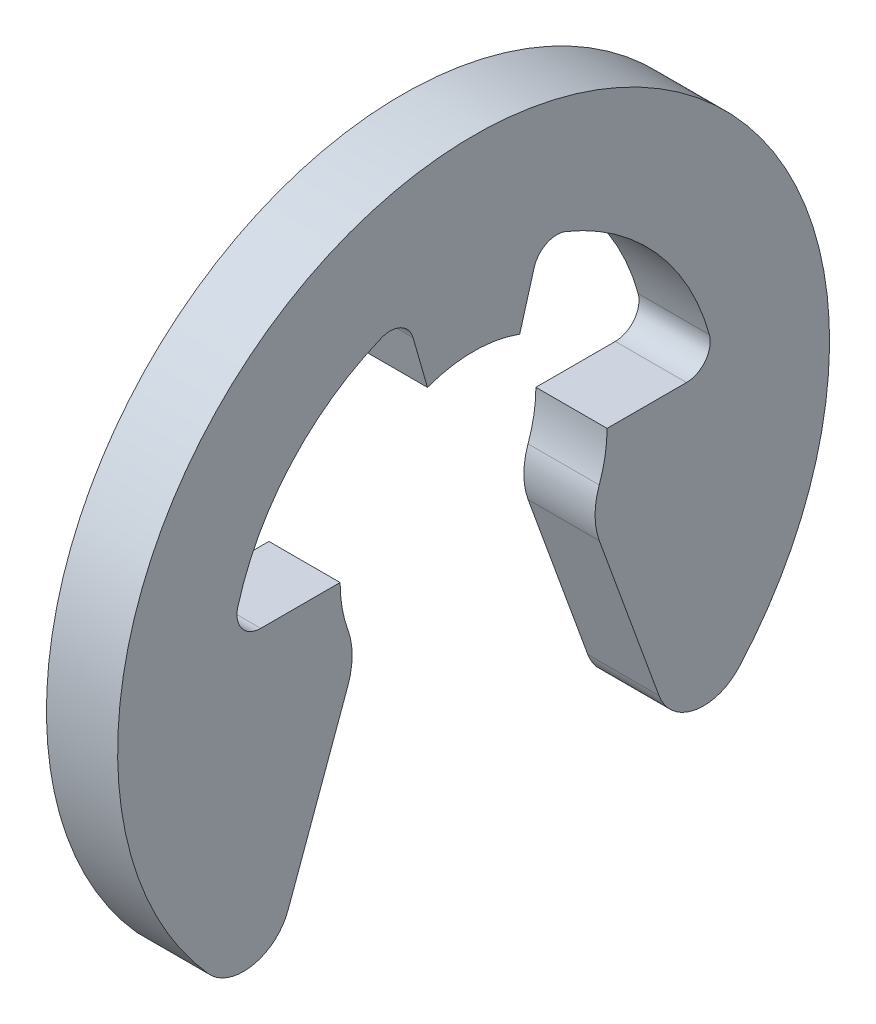
ISO-10303-21;
HEADER;
FILE_DESCRIPTION(('STEP AP214'),'2;1');
FILE_NAME('part.step','',(''),(''),'','','');
FILE_SCHEMA(('AUTOMOTIVE_DESIGN { 1 0 10303 214 1 1 1 1 }'));
ENDSEC;
DATA;
#1=APPLICATION_CONTEXT('core data for automotive mechanical design processes');
#2=APPLICATION_PROTOCOL_DEFINITION('international standard','automotive_design',2000,#1);
#3=PRODUCT_CONTEXT('',#1,'mechanical');
#4=PRODUCT('Part','Part','',(#3));
#5=PRODUCT_RELATED_PRODUCT_CATEGORY('part','',(#4));
#6=PRODUCT_DEFINITION_FORMATION('','',#4);
#7=PRODUCT_DEFINITION_CONTEXT('part definition',#1,'design');
#8=PRODUCT_DEFINITION('design','',#6,#7);
#9=PRODUCT_DEFINITION_SHAPE('','',#8);
#10=(LENGTH_UNIT() NAMED_UNIT(*) SI_UNIT(.MILLI.,.METRE.));
#11=(NAMED_UNIT(*) PLANE_ANGLE_UNIT() SI_UNIT($,.RADIAN.));
#12=(NAMED_UNIT(*) SI_UNIT($,.STERADIAN.) SOLID_ANGLE_UNIT());
#13=UNCERTAINTY_MEASURE_WITH_UNIT(LENGTH_MEASURE(1.E-05),#10,'distance_accuracy_value','');
#14=(GEOMETRIC_REPRESENTATION_CONTEXT(3) GLOBAL_UNCERTAINTY_ASSIGNED_CONTEXT((#13)) GLOBAL_UNIT_ASSIGNED_CONTEXT((#10,
#11,#12)) REPRESENTATION_CONTEXT('',''));
#15=CARTESIAN_POINT('',(0.,0.,0.));
#16=DIRECTION('',(0.,0.,1.));
#17=DIRECTION('',(1.,0.,0.));
#18=AXIS2_PLACEMENT_3D('',#15,#16,#17);
#19=CARTESIAN_POINT('',(0.399999999999998,0.333333333333338,-1.19608737139061));
#20=DIRECTION('',(-1.,0.,0.));
#21=DIRECTION('',(0.,0.,1.));
#22=AXIS2_PLACEMENT_3D('',#19,#20,#21);
#23=CYLINDRICAL_SURFACE('',#22,0.133333333333334);
#24=CARTESIAN_POINT('',(0.,0.333333333333338,-1.19608737139061));
#25=DIRECTION('',(-1.,0.,0.));
#26=DIRECTION('',(0.,0.,1.));
#27=AXIS2_PLACEMENT_3D('',#24,#25,#26);
#28=CIRCLE('',#27,0.133333333333334);
#29=CARTESIAN_POINT('',(0.,0.369127516778589,-1.32452628375462));
#30=VERTEX_POINT('',#29);
#31=CARTESIAN_POINT('',(0.,0.200000000000033,-1.19608737139058));
#32=VERTEX_POINT('',#31);
#33=EDGE_CURVE('E199',#30,#32,#28,.T.);
#34=ORIENTED_EDGE('',*,*,#33,.T.);
#35=DIRECTION('',(-1.,0.,0.));
#36=VECTOR('',#35,1.);
#37=CARTESIAN_POINT('',(0.399999999999998,0.200000000000033,-1.19608737139058));
#38=LINE('',#37,#36);
#39=CARTESIAN_POINT('',(0.399999999999998,0.200000000000033,-1.19608737139058));
#40=VERTEX_POINT('',#39);
#41=EDGE_CURVE('E11',#40,#32,#38,.T.);
#42=ORIENTED_EDGE('',*,*,#41,.F.);
#43=CARTESIAN_POINT('',(0.399999999999998,0.333333333333338,-1.19608737139061));
#44=DIRECTION('',(-1.,0.,0.));
#45=DIRECTION('',(0.,0.,1.));
#46=AXIS2_PLACEMENT_3D('',#43,#44,#45);
#47=CIRCLE('',#46,0.133333333333334);
#48=CARTESIAN_POINT('',(0.399999999999998,0.369127516778589,-1.32452628375462));
#49=VERTEX_POINT('',#48);
#50=EDGE_CURVE('E121',#49,#40,#47,.T.);
#51=ORIENTED_EDGE('',*,*,#50,.F.);
#52=DIRECTION('',(-1.,0.,0.));
#53=VECTOR('',#52,1.);
#54=CARTESIAN_POINT('',(0.399999999999998,0.369127516778589,-1.32452628375462));
#55=LINE('',#54,#53);
#56=EDGE_CURVE('E48',#49,#30,#55,.T.);
#57=ORIENTED_EDGE('',*,*,#56,.T.);
#58=EDGE_LOOP('',(#34,#42,#51,#57));
#59=FACE_BOUND('',#58,.T.);
#60=ADVANCED_FACE('F32',(#59),#23,.F.);
#61=CARTESIAN_POINT('',(0.399999999999998,0.200000000000033,-0.750000000000015));
#62=DIRECTION('',(0.,1.,0.));
#63=DIRECTION('',(0.,0.,1.));
#64=AXIS2_PLACEMENT_3D('',#61,#62,#63);
#65=PLANE('',#64);
#66=DIRECTION('',(0.,0.,-1.));
#67=VECTOR('',#66,1.);
#68=CARTESIAN_POINT('',(0.,0.200000000000033,-0.750000000000015));
#69=LINE('',#68,#67);
#70=CARTESIAN_POINT('',(0.,0.200000000000033,-0.750000000000015));
#71=VERTEX_POINT('',#70);
#72=EDGE_CURVE('E201',#71,#32,#69,.T.);
#73=ORIENTED_EDGE('',*,*,#72,.F.);
#74=DIRECTION('',(-1.,0.,0.));
#75=VECTOR('',#74,1.);
#76=CARTESIAN_POINT('',(0.399999999999998,0.200000000000033,-0.750000000000015));
#77=LINE('',#76,#75);
#78=CARTESIAN_POINT('',(0.399999999999998,0.200000000000033,-0.750000000000015));
#79=VERTEX_POINT('',#78);
#80=EDGE_CURVE('E40',#79,#71,#77,.T.);
#81=ORIENTED_EDGE('',*,*,#80,.F.);
#82=DIRECTION('',(0.,0.,-1.));
#83=VECTOR('',#82,1.);
#84=CARTESIAN_POINT('',(0.399999999999998,0.200000000000033,-0.750000000000015));
#85=LINE('',#84,#83);
#86=EDGE_CURVE('E299',#79,#40,#85,.T.);
#87=ORIENTED_EDGE('',*,*,#86,.T.);
#88=ORIENTED_EDGE('',*,*,#41,.T.);
#89=EDGE_LOOP('',(#73,#81,#87,#88));
#90=FACE_BOUND('',#89,.T.);
#91=ADVANCED_FACE('F298',(#90),#65,.T.);
#92=CARTESIAN_POINT('',(0.399999999999998,0.199999999999978,0.));
#93=DIRECTION('',(-1.,0.,0.));
#94=DIRECTION('',(0.,0.,1.));
#95=AXIS2_PLACEMENT_3D('',#92,#93,#94);
#96=CYLINDRICAL_SURFACE('',#95,0.75);
#97=CARTESIAN_POINT('',(0.,0.199999999999978,0.));
#98=DIRECTION('',(-1.,0.,0.));
#99=DIRECTION('',(0.,0.,1.));
#100=AXIS2_PLACEMENT_3D('',#97,#98,#99);
#101=CIRCLE('',#100,0.75);
#102=CARTESIAN_POINT('',(0.,-0.0533632223996827,-0.705908689233412));
#103=VERTEX_POINT('',#102);
#104=EDGE_CURVE('E204',#71,#103,#101,.T.);
#105=ORIENTED_EDGE('',*,*,#104,.T.);
#106=DIRECTION('',(-1.,0.,0.));
#107=VECTOR('',#106,1.);
#108=CARTESIAN_POINT('',(0.399999999999998,-0.0533632223996827,-0.705908689233412));
#109=LINE('',#108,#107);
#110=CARTESIAN_POINT('',(0.399999999999998,-0.0533632223996827,-0.705908689233412));
#111=VERTEX_POINT('',#110);
#112=EDGE_CURVE('E284',#111,#103,#109,.T.);
#113=ORIENTED_EDGE('',*,*,#112,.F.);
#114=CARTESIAN_POINT('',(0.399999999999998,0.199999999999978,0.));
#115=DIRECTION('',(-1.,0.,0.));
#116=DIRECTION('',(0.,0.,1.));
#117=AXIS2_PLACEMENT_3D('',#114,#115,#116);
#118=CIRCLE('',#117,0.75);
#119=EDGE_CURVE('E290',#79,#111,#118,.T.);
#120=ORIENTED_EDGE('',*,*,#119,.F.);
#121=ORIENTED_EDGE('',*,*,#80,.T.);
#122=EDGE_LOOP('',(#105,#113,#120,#121));
#123=FACE_BOUND('',#122,.T.);
#124=ADVANCED_FACE('F288',(#123),#96,.F.);
#125=CARTESIAN_POINT('',(0.399999999999998,-0.188490274346143,-1.08239332349122));
#126=DIRECTION('',(-1.,0.,0.));
#127=DIRECTION('',(0.,0.,1.));
#128=AXIS2_PLACEMENT_3D('',#125,#126,#127);
#129=CYLINDRICAL_SURFACE('',#128,0.399999999999999);
#130=CARTESIAN_POINT('',(0.,-0.188490274346143,-1.08239332349122));
#131=DIRECTION('',(-1.,0.,0.));
#132=DIRECTION('',(0.,0.,1.));
#133=AXIS2_PLACEMENT_3D('',#130,#131,#132);
#134=CIRCLE('',#133,0.399999999999999);
#135=CARTESIAN_POINT('',(0.,-0.32529833167641,-0.706516275176844));
#136=VERTEX_POINT('',#135);
#137=EDGE_CURVE('E207',#136,#103,#134,.T.);
#138=ORIENTED_EDGE('',*,*,#137,.F.);
#139=DIRECTION('',(-1.,0.,0.));
#140=VECTOR('',#139,1.);
#141=CARTESIAN_POINT('',(0.399999999999998,-0.32529833167641,-0.706516275176844));
#142=LINE('',#141,#140);
#143=CARTESIAN_POINT('',(0.399999999999998,-0.32529833167641,-0.706516275176844));
#144=VERTEX_POINT('',#143);
#145=EDGE_CURVE('E282',#144,#136,#142,.T.);
#146=ORIENTED_EDGE('',*,*,#145,.F.);
#147=CARTESIAN_POINT('',(0.399999999999998,-0.188490274346143,-1.08239332349122));
#148=DIRECTION('',(-1.,0.,0.));
#149=DIRECTION('',(0.,0.,1.));
#150=AXIS2_PLACEMENT_3D('',#147,#148,#149);
#151=CIRCLE('',#150,0.399999999999999);
#152=EDGE_CURVE('E547',#144,#111,#151,.T.);
#153=ORIENTED_EDGE('',*,*,#152,.T.);
#154=ORIENTED_EDGE('',*,*,#112,.T.);
#155=EDGE_LOOP('',(#138,#146,#153,#154));
#156=FACE_BOUND('',#155,.T.);
#157=ADVANCED_FACE('F317',(#156),#129,.T.);
#158=CARTESIAN_POINT('',(0.399999999999998,-0.32529833167641,-0.706516275176844));
#159=DIRECTION('',(0.,0.34202014332567,-0.939692620785908));
#160=DIRECTION('',(0.,0.939692620785908,0.34202014332567));
#161=AXIS2_PLACEMENT_3D('',#158,#159,#160);
#162=PLANE('',#161);
#163=DIRECTION('',(0.,-0.939692620785908,-0.34202014332567));
#164=VECTOR('',#163,1.);
#165=CARTESIAN_POINT('',(0.,-0.32529833167641,-0.706516275176844));
#166=LINE('',#165,#164);
#167=CARTESIAN_POINT('',(0.,-1.2463352508001,-1.04174629839815));
#168=VERTEX_POINT('',#167);
#169=EDGE_CURVE('E210',#136,#168,#166,.T.);
#170=ORIENTED_EDGE('',*,*,#169,.T.);
#171=DIRECTION('',(-1.,0.,0.));
#172=VECTOR('',#171,1.);
#173=CARTESIAN_POINT('',(0.399999999999998,-1.2463352508001,-1.04174629839815));
#174=LINE('',#173,#172);
#175=CARTESIAN_POINT('',(0.399999999999998,-1.2463352508001,-1.04174629839815));
#176=VERTEX_POINT('',#175);
#177=EDGE_CURVE('E280',#176,#168,#174,.T.);
#178=ORIENTED_EDGE('',*,*,#177,.F.);
#179=DIRECTION('',(0.,-0.939692620785908,-0.34202014332567));
#180=VECTOR('',#179,1.);
#181=CARTESIAN_POINT('',(0.399999999999998,-0.32529833167641,-0.706516275176844));
#182=LINE('',#181,#180);
#183=EDGE_CURVE('E548',#144,#176,#182,.T.);
#184=ORIENTED_EDGE('',*,*,#183,.F.);
#185=ORIENTED_EDGE('',*,*,#145,.T.);
#186=EDGE_LOOP('',(#170,#178,#184,#185));
#187=FACE_BOUND('',#186,.T.);
#188=ADVANCED_FACE('F322',(#187),#162,.F.);
#189=CARTESIAN_POINT('',(0.399999999999998,-1.15512987924656,-1.29233099727437));
#190=DIRECTION('',(-1.,0.,0.));
#191=DIRECTION('',(0.,0.,1.));
#192=AXIS2_PLACEMENT_3D('',#189,#190,#191);
#193=CYLINDRICAL_SURFACE('',#192,0.266666666666666);
#194=CARTESIAN_POINT('',(0.,-1.1551298792466,-1.29233099727437));
#195=DIRECTION('',(-1.,0.,0.));
#196=DIRECTION('',(0.,0.,1.));
#197=AXIS2_PLACEMENT_3D('',#194,#195,#196);
#198=CIRCLE('',#197,0.266666666666666);
#199=CARTESIAN_POINT('',(0.,-1.33284216836142,-1.49115115070117));
#200=VERTEX_POINT('',#199);
#201=EDGE_CURVE('E213',#200,#168,#198,.T.);
#202=ORIENTED_EDGE('',*,*,#201,.F.);
#203=DIRECTION('',(-1.,0.,0.));
#204=VECTOR('',#203,1.);
#205=CARTESIAN_POINT('',(0.399999999999998,-1.33284216836142,-1.49115115070117));
#206=LINE('',#205,#204);
#207=CARTESIAN_POINT('',(0.399999999999998,-1.33284216836142,-1.49115115070117));
#208=VERTEX_POINT('',#207);
#209=EDGE_CURVE('E278',#208,#200,#206,.T.);
#210=ORIENTED_EDGE('',*,*,#209,.F.);
#211=CARTESIAN_POINT('',(0.399999999999998,-1.15512987924656,-1.29233099727437));
#212=DIRECTION('',(-1.,0.,0.));
#213=DIRECTION('',(0.,0.,1.));
#214=AXIS2_PLACEMENT_3D('',#211,#212,#213);
#215=CIRCLE('',#214,0.266666666666666);
#216=EDGE_CURVE('E543',#208,#176,#215,.T.);
#217=ORIENTED_EDGE('',*,*,#216,.T.);
#218=ORIENTED_EDGE('',*,*,#177,.T.);
#219=EDGE_LOOP('',(#202,#210,#217,#218));
#220=FACE_BOUND('',#219,.T.);
#221=ADVANCED_FACE('F326',(#220),#193,.T.);
#222=CARTESIAN_POINT('',(0.399999999999998,0.,0.));
#223=DIRECTION('',(-1.,0.,0.));
#224=DIRECTION('',(0.,0.,1.));
#225=AXIS2_PLACEMENT_3D('',#222,#223,#224);
#226=CYLINDRICAL_SURFACE('',#225,2.);
#227=CARTESIAN_POINT('',(0.,0.,0.));
#228=DIRECTION('',(1.,0.,0.));
#229=DIRECTION('',(0.,0.,-1.));
#230=AXIS2_PLACEMENT_3D('',#227,#228,#229);
#231=CIRCLE('',#230,2.);
#232=CARTESIAN_POINT('',(0.,-1.33284216836142,1.4911511507012));
#233=VERTEX_POINT('',#232);
#234=EDGE_CURVE('E216',#200,#233,#231,.T.);
#235=ORIENTED_EDGE('',*,*,#234,.T.);
#236=DIRECTION('',(-1.,0.,0.));
#237=VECTOR('',#236,1.);
#238=CARTESIAN_POINT('',(0.399999999999998,-1.33284216836142,1.4911511507012));
#239=LINE('',#238,#237);
#240=CARTESIAN_POINT('',(0.399999999999998,-1.33284216836142,1.4911511507012));
#241=VERTEX_POINT('',#240);
#242=EDGE_CURVE('E275',#241,#233,#239,.T.);
#243=ORIENTED_EDGE('',*,*,#242,.F.);
#244=CARTESIAN_POINT('',(0.399999999999998,0.,0.));
#245=DIRECTION('',(1.,0.,0.));
#246=DIRECTION('',(0.,0.,-1.));
#247=AXIS2_PLACEMENT_3D('',#244,#245,#246);
#248=CIRCLE('',#247,2.);
#249=EDGE_CURVE('E555',#208,#241,#248,.T.);
#250=ORIENTED_EDGE('',*,*,#249,.F.);
#251=ORIENTED_EDGE('',*,*,#209,.T.);
#252=EDGE_LOOP('',(#235,#243,#250,#251));
#253=FACE_BOUND('',#252,.T.);
#254=ADVANCED_FACE('F330',(#253),#226,.T.);
#255=CARTESIAN_POINT('',(0.399999999999998,-1.15512987924658,1.29233099727437));
#256=DIRECTION('',(-1.,0.,0.));
#257=DIRECTION('',(0.,0.,1.));
#258=AXIS2_PLACEMENT_3D('',#255,#256,#257);
#259=CYLINDRICAL_SURFACE('',#258,0.266666666666666);
#260=CARTESIAN_POINT('',(0.,-1.15512987924658,1.29233099727437));
#261=DIRECTION('',(1.,0.,0.));
#262=DIRECTION('',(0.,0.,-1.));
#263=AXIS2_PLACEMENT_3D('',#260,#261,#262);
#264=CIRCLE('',#263,0.266666666666666);
#265=CARTESIAN_POINT('',(0.,-1.24633525080002,1.04174629839812));
#266=VERTEX_POINT('',#265);
#267=EDGE_CURVE('E218',#233,#266,#264,.T.);
#268=ORIENTED_EDGE('',*,*,#267,.T.);
#269=DIRECTION('',(-1.,0.,0.));
#270=VECTOR('',#269,1.);
#271=CARTESIAN_POINT('',(0.399999999999998,-1.24633525080002,1.04174629839812));
#272=LINE('',#271,#270);
#273=CARTESIAN_POINT('',(0.399999999999998,-1.24633525080002,1.04174629839812));
#274=VERTEX_POINT('',#273);
#275=EDGE_CURVE('E273',#274,#266,#272,.T.);
#276=ORIENTED_EDGE('',*,*,#275,.F.);
#277=CARTESIAN_POINT('',(0.399999999999998,-1.15512987924658,1.29233099727437));
#278=DIRECTION('',(1.,0.,0.));
#279=DIRECTION('',(0.,0.,-1.));
#280=AXIS2_PLACEMENT_3D('',#277,#278,#279);
#281=CIRCLE('',#280,0.266666666666666);
#282=EDGE_CURVE('E557',#241,#274,#281,.T.);
#283=ORIENTED_EDGE('',*,*,#282,.F.);
#284=ORIENTED_EDGE('',*,*,#242,.T.);
#285=EDGE_LOOP('',(#268,#276,#283,#284));
#286=FACE_BOUND('',#285,.T.);
#287=ADVANCED_FACE('F334',(#286),#259,.T.);
#288=CARTESIAN_POINT('',(0.399999999999998,-0.325298331676438,0.706516275176886));
#289=DIRECTION('',(0.,-0.342020143325672,-0.939692620785908));
#290=DIRECTION('',(0.,0.939692620785908,-0.342020143325672));
#291=AXIS2_PLACEMENT_3D('',#288,#289,#290);
#292=PLANE('',#291);
#293=DIRECTION('',(0.,-0.939692620785908,0.342020143325672));
#294=VECTOR('',#293,1.);
#295=CARTESIAN_POINT('',(0.,-0.325298331676438,0.706516275176886));
#296=LINE('',#295,#294);
#297=CARTESIAN_POINT('',(0.,-0.325298331676438,0.706516275176886));
#298=VERTEX_POINT('',#297);
#299=EDGE_CURVE('E221',#298,#266,#296,.T.);
#300=ORIENTED_EDGE('',*,*,#299,.F.);
#301=DIRECTION('',(-1.,0.,0.));
#302=VECTOR('',#301,1.);
#303=CARTESIAN_POINT('',(0.399999999999998,-0.325298331676438,0.706516275176886));
#304=LINE('',#303,#302);
#305=CARTESIAN_POINT('',(0.399999999999998,-0.325298331676438,0.706516275176886));
#306=VERTEX_POINT('',#305);
#307=EDGE_CURVE('E271',#306,#298,#304,.T.);
#308=ORIENTED_EDGE('',*,*,#307,.F.);
#309=DIRECTION('',(0.,-0.939692620785908,0.342020143325672));
#310=VECTOR('',#309,1.);
#311=CARTESIAN_POINT('',(0.399999999999998,-0.325298331676438,0.706516275176886));
#312=LINE('',#311,#310);
#313=EDGE_CURVE('E534',#306,#274,#312,.T.);
#314=ORIENTED_EDGE('',*,*,#313,.T.);
#315=ORIENTED_EDGE('',*,*,#275,.T.);
#316=EDGE_LOOP('',(#300,#308,#314,#315));
#317=FACE_BOUND('',#316,.T.);
#318=ADVANCED_FACE('F338',(#317),#292,.T.);
#319=CARTESIAN_POINT('',(0.399999999999998,-0.18849027434617,1.08239332349121));
#320=DIRECTION('',(-1.,0.,0.));
#321=DIRECTION('',(0.,0.,1.));
#322=AXIS2_PLACEMENT_3D('',#319,#320,#321);
#323=CYLINDRICAL_SURFACE('',#322,0.4);
#324=CARTESIAN_POINT('',(0.,-0.18849027434617,1.08239332349121));
#325=DIRECTION('',(1.,0.,0.));
#326=DIRECTION('',(0.,0.,-1.));
#327=AXIS2_PLACEMENT_3D('',#324,#325,#326);
#328=CIRCLE('',#327,0.4);
#329=CARTESIAN_POINT('',(0.,-0.0533632223996827,0.705908689233412));
#330=VERTEX_POINT('',#329);
#331=EDGE_CURVE('E224',#298,#330,#328,.T.);
#332=ORIENTED_EDGE('',*,*,#331,.T.);
#333=DIRECTION('',(-1.,0.,0.));
#334=VECTOR('',#333,1.);
#335=CARTESIAN_POINT('',(0.399999999999998,-0.0533632223996827,0.705908689233412));
#336=LINE('',#335,#334);
#337=CARTESIAN_POINT('',(0.399999999999998,-0.0533632223996827,0.705908689233412));
#338=VERTEX_POINT('',#337);
#339=EDGE_CURVE('E269',#338,#330,#336,.T.);
#340=ORIENTED_EDGE('',*,*,#339,.F.);
#341=CARTESIAN_POINT('',(0.399999999999998,-0.18849027434617,1.08239332349121));
#342=DIRECTION('',(1.,0.,0.));
#343=DIRECTION('',(0.,0.,-1.));
#344=AXIS2_PLACEMENT_3D('',#341,#342,#343);
#345=CIRCLE('',#344,0.4);
#346=EDGE_CURVE('E560',#306,#338,#345,.T.);
#347=ORIENTED_EDGE('',*,*,#346,.F.);
#348=ORIENTED_EDGE('',*,*,#307,.T.);
#349=EDGE_LOOP('',(#332,#340,#347,#348));
#350=FACE_BOUND('',#349,.T.);
#351=ADVANCED_FACE('F342',(#350),#323,.T.);
#352=CARTESIAN_POINT('',(0.399999999999998,0.199999999999978,0.));
#353=DIRECTION('',(-1.,0.,0.));
#354=DIRECTION('',(0.,0.,1.));
#355=AXIS2_PLACEMENT_3D('',#352,#353,#354);
#356=CYLINDRICAL_SURFACE('',#355,0.75);
#357=CARTESIAN_POINT('',(0.,0.199999999999978,0.));
#358=DIRECTION('',(1.,0.,0.));
#359=DIRECTION('',(0.,0.,-1.));
#360=AXIS2_PLACEMENT_3D('',#357,#358,#359);
#361=CIRCLE('',#360,0.75);
#362=CARTESIAN_POINT('',(0.,0.200000000000033,0.750000000000015));
#363=VERTEX_POINT('',#362);
#364=EDGE_CURVE('E227',#363,#330,#361,.T.);
#365=ORIENTED_EDGE('',*,*,#364,.F.);
#366=DIRECTION('',(-1.,0.,0.));
#367=VECTOR('',#366,1.);
#368=CARTESIAN_POINT('',(0.399999999999998,0.200000000000033,0.750000000000015));
#369=LINE('',#368,#367);
#370=CARTESIAN_POINT('',(0.399999999999998,0.200000000000033,0.750000000000015));
#371=VERTEX_POINT('',#370);
#372=EDGE_CURVE('E267',#371,#363,#369,.T.);
#373=ORIENTED_EDGE('',*,*,#372,.F.);
#374=CARTESIAN_POINT('',(0.399999999999998,0.199999999999978,0.));
#375=DIRECTION('',(1.,0.,0.));
#376=DIRECTION('',(0.,0.,-1.));
#377=AXIS2_PLACEMENT_3D('',#374,#375,#376);
#378=CIRCLE('',#377,0.75);
#379=EDGE_CURVE('E527',#371,#338,#378,.T.);
#380=ORIENTED_EDGE('',*,*,#379,.T.);
#381=ORIENTED_EDGE('',*,*,#339,.T.);
#382=EDGE_LOOP('',(#365,#373,#380,#381));
#383=FACE_BOUND('',#382,.T.);
#384=ADVANCED_FACE('F346',(#383),#356,.F.);
#385=CARTESIAN_POINT('',(0.399999999999998,0.200000000000033,0.750000000000015));
#386=DIRECTION('',(0.,-1.,0.));
#387=DIRECTION('',(0.,0.,-1.));
#388=AXIS2_PLACEMENT_3D('',#385,#386,#387);
#389=PLANE('',#388);
#390=DIRECTION('',(0.,0.,1.));
#391=VECTOR('',#390,1.);
#392=CARTESIAN_POINT('',(0.,0.200000000000033,0.750000000000015));
#393=LINE('',#392,#391);
#394=CARTESIAN_POINT('',(0.,0.200000000000047,1.19608737139056));
#395=VERTEX_POINT('',#394);
#396=EDGE_CURVE('E230',#363,#395,#393,.T.);
#397=ORIENTED_EDGE('',*,*,#396,.T.);
#398=DIRECTION('',(-1.,0.,0.));
#399=VECTOR('',#398,1.);
#400=CARTESIAN_POINT('',(0.399999999999998,0.200000000000047,1.19608737139056));
#401=LINE('',#400,#399);
#402=CARTESIAN_POINT('',(0.399999999999998,0.200000000000047,1.19608737139056));
#403=VERTEX_POINT('',#402);
#404=EDGE_CURVE('E265',#403,#395,#401,.T.);
#405=ORIENTED_EDGE('',*,*,#404,.F.);
#406=DIRECTION('',(0.,0.,1.));
#407=VECTOR('',#406,1.);
#408=CARTESIAN_POINT('',(0.399999999999998,0.200000000000033,0.750000000000015));
#409=LINE('',#408,#407);
#410=EDGE_CURVE('E563',#371,#403,#409,.T.);
#411=ORIENTED_EDGE('',*,*,#410,.F.);
#412=ORIENTED_EDGE('',*,*,#372,.T.);
#413=EDGE_LOOP('',(#397,#405,#411,#412));
#414=FACE_BOUND('',#413,.T.);
#415=ADVANCED_FACE('F350',(#414),#389,.F.);
#416=CARTESIAN_POINT('',(0.399999999999998,0.333333333333352,1.19608737139053));
#417=DIRECTION('',(-1.,0.,0.));
#418=DIRECTION('',(0.,0.,1.));
#419=AXIS2_PLACEMENT_3D('',#416,#417,#418);
#420=CYLINDRICAL_SURFACE('',#419,0.133333333333334);
#421=CARTESIAN_POINT('',(0.,0.333333333333352,1.19608737139053));
#422=DIRECTION('',(1.,0.,0.));
#423=DIRECTION('',(0.,0.,-1.));
#424=AXIS2_PLACEMENT_3D('',#421,#422,#423);
#425=CIRCLE('',#424,0.133333333333334);
#426=CARTESIAN_POINT('',(0.,0.369127516778589,1.32452628375467));
#427=VERTEX_POINT('',#426);
#428=EDGE_CURVE('E233',#427,#395,#425,.T.);
#429=ORIENTED_EDGE('',*,*,#428,.F.);
#430=DIRECTION('',(-1.,0.,0.));
#431=VECTOR('',#430,1.);
#432=CARTESIAN_POINT('',(0.399999999999998,0.369127516778589,1.32452628375467));
#433=LINE('',#432,#431);
#434=CARTESIAN_POINT('',(0.399999999999998,0.369127516778589,1.32452628375467));
#435=VERTEX_POINT('',#434);
#436=EDGE_CURVE('E263',#435,#427,#433,.T.);
#437=ORIENTED_EDGE('',*,*,#436,.F.);
#438=CARTESIAN_POINT('',(0.399999999999998,0.333333333333352,1.19608737139053));
#439=DIRECTION('',(1.,0.,0.));
#440=DIRECTION('',(0.,0.,-1.));
#441=AXIS2_PLACEMENT_3D('',#438,#439,#440);
#442=CIRCLE('',#441,0.133333333333334);
#443=EDGE_CURVE('E520',#435,#403,#442,.T.);
#444=ORIENTED_EDGE('',*,*,#443,.T.);
#445=ORIENTED_EDGE('',*,*,#404,.T.);
#446=EDGE_LOOP('',(#429,#437,#444,#445));
#447=FACE_BOUND('',#446,.T.);
#448=ADVANCED_FACE('F354',(#447),#420,.F.);
#449=CARTESIAN_POINT('',(0.399999999999998,0.,0.));
#450=DIRECTION('',(-1.,0.,0.));
#451=DIRECTION('',(0.,0.,1.));
#452=AXIS2_PLACEMENT_3D('',#449,#450,#451);
#453=CYLINDRICAL_SURFACE('',#452,1.375);
#454=CARTESIAN_POINT('',(0.,0.,0.));
#455=DIRECTION('',(-1.,0.,0.));
#456=DIRECTION('',(0.,0.,1.));
#457=AXIS2_PLACEMENT_3D('',#454,#455,#456);
#458=CIRCLE('',#457,1.375);
#459=CARTESIAN_POINT('',(0.,1.27339413315071,0.518741150919586));
#460=VERTEX_POINT('',#459);
#461=EDGE_CURVE('E236',#427,#460,#458,.T.);
#462=ORIENTED_EDGE('',*,*,#461,.T.);
#463=DIRECTION('',(-1.,0.,0.));
#464=VECTOR('',#463,1.);
#465=CARTESIAN_POINT('',(0.399999999999998,1.27339413315071,0.518741150919586));
#466=LINE('',#465,#464);
#467=CARTESIAN_POINT('',(0.399999999999998,1.27339413315071,0.518741150919586));
#468=VERTEX_POINT('',#467);
#469=EDGE_CURVE('E260',#468,#460,#466,.T.);
#470=ORIENTED_EDGE('',*,*,#469,.F.);
#471=CARTESIAN_POINT('',(0.399999999999998,0.,0.));
#472=DIRECTION('',(-1.,0.,0.));
#473=DIRECTION('',(0.,0.,1.));
#474=AXIS2_PLACEMENT_3D('',#471,#472,#473);
#475=CIRCLE('',#474,1.375);
#476=EDGE_CURVE('E514',#435,#468,#475,.T.);
#477=ORIENTED_EDGE('',*,*,#476,.F.);
#478=ORIENTED_EDGE('',*,*,#436,.T.);
#479=EDGE_LOOP('',(#462,#470,#477,#478));
#480=FACE_BOUND('',#479,.T.);
#481=ADVANCED_FACE('F358',(#480),#453,.F.);
#482=CARTESIAN_POINT('',(0.399999999999998,1.14991348993609,0.468438978709171));
#483=DIRECTION('',(-1.,0.,0.));
#484=DIRECTION('',(0.,0.,1.));
#485=AXIS2_PLACEMENT_3D('',#482,#483,#484);
#486=CYLINDRICAL_SURFACE('',#485,0.133333333333333);
#487=CARTESIAN_POINT('',(0.,1.14991348993609,0.468438978709171));
#488=DIRECTION('',(-1.,0.,0.));
#489=DIRECTION('',(0.,0.,1.));
#490=AXIS2_PLACEMENT_3D('',#487,#488,#489);
#491=CIRCLE('',#490,0.133333333333333);
#492=CARTESIAN_POINT('',(0.,1.18666513737838,0.34027075258404));
#493=VERTEX_POINT('',#492);
#494=EDGE_CURVE('E238',#460,#493,#491,.T.);
#495=ORIENTED_EDGE('',*,*,#494,.T.);
#496=DIRECTION('',(-1.,0.,0.));
#497=VECTOR('',#496,1.);
#498=CARTESIAN_POINT('',(0.399999999999998,1.18666513737838,0.34027075258404));
#499=LINE('',#498,#497);
#500=CARTESIAN_POINT('',(0.399999999999998,1.18666513737838,0.34027075258404));
#501=VERTEX_POINT('',#500);
#502=EDGE_CURVE('E258',#501,#493,#499,.T.);
#503=ORIENTED_EDGE('',*,*,#502,.F.);
#504=CARTESIAN_POINT('',(0.399999999999998,1.14991348993609,0.468438978709171));
#505=DIRECTION('',(-1.,0.,0.));
#506=DIRECTION('',(0.,0.,1.));
#507=AXIS2_PLACEMENT_3D('',#504,#505,#506);
#508=CIRCLE('',#507,0.133333333333333);
#509=EDGE_CURVE('E512',#468,#501,#508,.T.);
#510=ORIENTED_EDGE('',*,*,#509,.F.);
#511=ORIENTED_EDGE('',*,*,#469,.T.);
#512=EDGE_LOOP('',(#495,#503,#510,#511));
#513=FACE_BOUND('',#512,.T.);
#514=ADVANCED_FACE('F362',(#513),#486,.F.);
#515=CARTESIAN_POINT('',(0.399999999999998,0.903800903331017,0.259160738674796));
#516=DIRECTION('',(0.,-0.275637355816994,0.961261695938321));
#517=DIRECTION('',(0.,-0.961261695938321,-0.275637355816994));
#518=AXIS2_PLACEMENT_3D('',#515,#516,#517);
#519=PLANE('',#518);
#520=DIRECTION('',(0.,0.961261695938321,0.275637355816994));
#521=VECTOR('',#520,1.);
#522=CARTESIAN_POINT('',(0.,0.903800903331017,0.259160738674796));
#523=LINE('',#522,#521);
#524=CARTESIAN_POINT('',(0.,0.903800903331017,0.259160738674796));
#525=VERTEX_POINT('',#524);
#526=EDGE_CURVE('E241',#525,#493,#523,.T.);
#527=ORIENTED_EDGE('',*,*,#526,.F.);
#528=DIRECTION('',(-1.,0.,0.));
#529=VECTOR('',#528,1.);
#530=CARTESIAN_POINT('',(0.399999999999998,0.903800903331017,0.259160738674796));
#531=LINE('',#530,#529);
#532=CARTESIAN_POINT('',(0.399999999999998,0.903800903331017,0.259160738674796));
#533=VERTEX_POINT('',#532);
#534=EDGE_CURVE('E256',#533,#525,#531,.T.);
#535=ORIENTED_EDGE('',*,*,#534,.F.);
#536=DIRECTION('',(0.,0.961261695938321,0.275637355816994));
#537=VECTOR('',#536,1.);
#538=CARTESIAN_POINT('',(0.399999999999998,0.903800903331017,0.259160738674796));
#539=LINE('',#538,#537);
#540=EDGE_CURVE('E509',#533,#501,#539,.T.);
#541=ORIENTED_EDGE('',*,*,#540,.T.);
#542=ORIENTED_EDGE('',*,*,#502,.T.);
#543=EDGE_LOOP('',(#527,#535,#541,#542));
#544=FACE_BOUND('',#543,.T.);
#545=ADVANCED_FACE('F366',(#544),#519,.T.);
#546=CARTESIAN_POINT('',(0.399999999999998,0.199999999999978,0.));
#547=DIRECTION('',(-1.,0.,0.));
#548=DIRECTION('',(0.,0.,1.));
#549=AXIS2_PLACEMENT_3D('',#546,#547,#548);
#550=CYLINDRICAL_SURFACE('',#549,0.75);
#551=CARTESIAN_POINT('',(0.,0.199999999999978,0.));
#552=DIRECTION('',(1.,0.,0.));
#553=DIRECTION('',(0.,0.,-1.));
#554=AXIS2_PLACEMENT_3D('',#551,#552,#553);
#555=CIRCLE('',#554,0.75);
#556=CARTESIAN_POINT('',(0.,0.903800903331059,-0.259160738674796));
#557=VERTEX_POINT('',#556);
#558=EDGE_CURVE('E244',#557,#525,#555,.T.);
#559=ORIENTED_EDGE('',*,*,#558,.F.);
#560=DIRECTION('',(-1.,0.,0.));
#561=VECTOR('',#560,1.);
#562=CARTESIAN_POINT('',(0.399999999999998,0.903800903331059,-0.259160738674796));
#563=LINE('',#562,#561);
#564=CARTESIAN_POINT('',(0.399999999999998,0.903800903331059,-0.259160738674796));
#565=VERTEX_POINT('',#564);
#566=EDGE_CURVE('E191',#565,#557,#563,.T.);
#567=ORIENTED_EDGE('',*,*,#566,.F.);
#568=CARTESIAN_POINT('',(0.399999999999998,0.199999999999978,0.));
#569=DIRECTION('',(1.,0.,0.));
#570=DIRECTION('',(0.,0.,-1.));
#571=AXIS2_PLACEMENT_3D('',#568,#569,#570);
#572=CIRCLE('',#571,0.75);
#573=EDGE_CURVE('E181',#565,#533,#572,.T.);
#574=ORIENTED_EDGE('',*,*,#573,.T.);
#575=ORIENTED_EDGE('',*,*,#534,.T.);
#576=EDGE_LOOP('',(#559,#567,#574,#575));
#577=FACE_BOUND('',#576,.T.);
#578=ADVANCED_FACE('F370',(#577),#550,.F.);
#579=CARTESIAN_POINT('',(0.399999999999998,0.903800903331059,-0.259160738674796));
#580=DIRECTION('',(0.,0.275637355816993,0.961261695938322));
#581=DIRECTION('',(0.,-0.961261695938322,0.275637355816993));
#582=AXIS2_PLACEMENT_3D('',#579,#580,#581);
#583=PLANE('',#582);
#584=DIRECTION('',(0.,0.961261695938322,-0.275637355816993));
#585=VECTOR('',#584,1.);
#586=CARTESIAN_POINT('',(0.,0.903800903331059,-0.259160738674796));
#587=LINE('',#586,#585);
#588=CARTESIAN_POINT('',(0.,1.18666513737835,-0.340270752584082));
#589=VERTEX_POINT('',#588);
#590=EDGE_CURVE('E188',#557,#589,#587,.T.);
#591=ORIENTED_EDGE('',*,*,#590,.T.);
#592=DIRECTION('',(-1.,0.,0.));
#593=VECTOR('',#592,1.);
#594=CARTESIAN_POINT('',(0.399999999999998,1.18666513737835,-0.340270752584082));
#595=LINE('',#594,#593);
#596=CARTESIAN_POINT('',(0.399999999999998,1.18666513737835,-0.340270752584082));
#597=VERTEX_POINT('',#596);
#598=EDGE_CURVE('E185',#597,#589,#595,.T.);
#599=ORIENTED_EDGE('',*,*,#598,.F.);
#600=DIRECTION('',(0.,0.961261695938322,-0.275637355816993));
#601=VECTOR('',#600,1.);
#602=CARTESIAN_POINT('',(0.399999999999998,0.903800903331059,-0.259160738674796));
#603=LINE('',#602,#601);
#604=EDGE_CURVE('E174',#565,#597,#603,.T.);
#605=ORIENTED_EDGE('',*,*,#604,.F.);
#606=ORIENTED_EDGE('',*,*,#566,.T.);
#607=EDGE_LOOP('',(#591,#599,#605,#606));
#608=FACE_BOUND('',#607,.T.);
#609=ADVANCED_FACE('F186',(#608),#583,.F.);
#610=CARTESIAN_POINT('',(0.399999999999998,1.14991348993616,-0.468438978709199));
#611=DIRECTION('',(-1.,0.,0.));
#612=DIRECTION('',(0.,0.,1.));
#613=AXIS2_PLACEMENT_3D('',#610,#611,#612);
#614=CYLINDRICAL_SURFACE('',#613,0.133333333333333);
#615=CARTESIAN_POINT('',(0.,1.14991348993616,-0.468438978709199));
#616=DIRECTION('',(1.,0.,0.));
#617=DIRECTION('',(0.,0.,-1.));
#618=AXIS2_PLACEMENT_3D('',#615,#616,#617);
#619=CIRCLE('',#618,0.133333333333333);
#620=CARTESIAN_POINT('',(0.,1.2733941331507,-0.518741150919572));
#621=VERTEX_POINT('',#620);
#622=EDGE_CURVE('E248',#621,#589,#619,.T.);
#623=ORIENTED_EDGE('',*,*,#622,.F.);
#624=DIRECTION('',(-1.,0.,0.));
#625=VECTOR('',#624,1.);
#626=CARTESIAN_POINT('',(0.399999999999998,1.2733941331507,-0.518741150919572));
#627=LINE('',#626,#625);
#628=CARTESIAN_POINT('',(0.399999999999998,1.2733941331507,-0.518741150919572));
#629=VERTEX_POINT('',#628);
#630=EDGE_CURVE('E109',#629,#621,#627,.T.);
#631=ORIENTED_EDGE('',*,*,#630,.F.);
#632=CARTESIAN_POINT('',(0.399999999999998,1.14991348993616,-0.468438978709199));
#633=DIRECTION('',(1.,0.,0.));
#634=DIRECTION('',(0.,0.,-1.));
#635=AXIS2_PLACEMENT_3D('',#632,#633,#634);
#636=CIRCLE('',#635,0.133333333333333);
#637=EDGE_CURVE('E178',#629,#597,#636,.T.);
#638=ORIENTED_EDGE('',*,*,#637,.T.);
#639=ORIENTED_EDGE('',*,*,#598,.T.);
#640=EDGE_LOOP('',(#623,#631,#638,#639));
#641=FACE_BOUND('',#640,.T.);
#642=ADVANCED_FACE('F193',(#641),#614,.F.);
#643=CARTESIAN_POINT('',(0.399999999999998,0.,0.));
#644=DIRECTION('',(-1.,0.,0.));
#645=DIRECTION('',(0.,0.,1.));
#646=AXIS2_PLACEMENT_3D('',#643,#644,#645);
#647=CYLINDRICAL_SURFACE('',#646,1.375);
#648=CARTESIAN_POINT('',(0.,0.,0.));
#649=DIRECTION('',(1.,0.,0.));
#650=DIRECTION('',(0.,0.,-1.));
#651=AXIS2_PLACEMENT_3D('',#648,#649,#650);
#652=CIRCLE('',#651,1.375);
#653=EDGE_CURVE('E250',#30,#621,#652,.T.);
#654=ORIENTED_EDGE('',*,*,#653,.F.);
#655=ORIENTED_EDGE('',*,*,#56,.F.);
#656=CARTESIAN_POINT('',(0.399999999999998,0.,0.));
#657=DIRECTION('',(1.,0.,0.));
#658=DIRECTION('',(0.,0.,-1.));
#659=AXIS2_PLACEMENT_3D('',#656,#657,#658);
#660=CIRCLE('',#659,1.375);
#661=EDGE_CURVE('E194',#49,#629,#660,.T.);
#662=ORIENTED_EDGE('',*,*,#661,.T.);
#663=ORIENTED_EDGE('',*,*,#630,.T.);
#664=EDGE_LOOP('',(#654,#655,#662,#663));
#665=FACE_BOUND('',#664,.T.);
#666=ADVANCED_FACE('F300',(#665),#647,.F.);
#667=CARTESIAN_POINT('',(0.399999999999998,0.333333333333338,-1.19608737139061));
#668=DIRECTION('',(-1.,0.,0.));
#669=DIRECTION('',(0.,0.,1.));
#670=AXIS2_PLACEMENT_3D('',#667,#668,#669);
#671=PLANE('',#670);
#672=ORIENTED_EDGE('',*,*,#50,.T.);
#673=ORIENTED_EDGE('',*,*,#86,.F.);
#674=ORIENTED_EDGE('',*,*,#119,.T.);
#675=ORIENTED_EDGE('',*,*,#152,.F.);
#676=ORIENTED_EDGE('',*,*,#183,.T.);
#677=ORIENTED_EDGE('',*,*,#216,.F.);
#678=ORIENTED_EDGE('',*,*,#249,.T.);
#679=ORIENTED_EDGE('',*,*,#282,.T.);
#680=ORIENTED_EDGE('',*,*,#313,.F.);
#681=ORIENTED_EDGE('',*,*,#346,.T.);
#682=ORIENTED_EDGE('',*,*,#379,.F.);
#683=ORIENTED_EDGE('',*,*,#410,.T.);
#684=ORIENTED_EDGE('',*,*,#443,.F.);
#685=ORIENTED_EDGE('',*,*,#476,.T.);
#686=ORIENTED_EDGE('',*,*,#509,.T.);
#687=ORIENTED_EDGE('',*,*,#540,.F.);
#688=ORIENTED_EDGE('',*,*,#573,.F.);
#689=ORIENTED_EDGE('',*,*,#604,.T.);
#690=ORIENTED_EDGE('',*,*,#637,.F.);
#691=ORIENTED_EDGE('',*,*,#661,.F.);
#692=EDGE_LOOP('',(#672,#673,#674,#675,#676,#677,#678,#679,#680,#681,#682,#683,#684,#685,#686,
#687,#688,#689,#690,#691));
#693=FACE_BOUND('',#692,.T.);
#694=ADVANCED_FACE('F176',(#693),#671,.F.);
#695=CARTESIAN_POINT('',(0.,0.333333333333338,-1.19608737139061));
#696=DIRECTION('',(-1.,0.,0.));
#697=DIRECTION('',(0.,0.,1.));
#698=AXIS2_PLACEMENT_3D('',#695,#696,#697);
#699=PLANE('',#698);
#700=ORIENTED_EDGE('',*,*,#33,.F.);
#701=ORIENTED_EDGE('',*,*,#653,.T.);
#702=ORIENTED_EDGE('',*,*,#622,.T.);
#703=ORIENTED_EDGE('',*,*,#590,.F.);
#704=ORIENTED_EDGE('',*,*,#558,.T.);
#705=ORIENTED_EDGE('',*,*,#526,.T.);
#706=ORIENTED_EDGE('',*,*,#494,.F.);
#707=ORIENTED_EDGE('',*,*,#461,.F.);
#708=ORIENTED_EDGE('',*,*,#428,.T.);
#709=ORIENTED_EDGE('',*,*,#396,.F.);
#710=ORIENTED_EDGE('',*,*,#364,.T.);
#711=ORIENTED_EDGE('',*,*,#331,.F.);
#712=ORIENTED_EDGE('',*,*,#299,.T.);
#713=ORIENTED_EDGE('',*,*,#267,.F.);
#714=ORIENTED_EDGE('',*,*,#234,.F.);
#715=ORIENTED_EDGE('',*,*,#201,.T.);
#716=ORIENTED_EDGE('',*,*,#169,.F.);
#717=ORIENTED_EDGE('',*,*,#137,.T.);
#718=ORIENTED_EDGE('',*,*,#104,.F.);
#719=ORIENTED_EDGE('',*,*,#72,.T.);
#720=EDGE_LOOP('',(#700,#701,#702,#703,#704,#705,#706,#707,#708,#709,#710,#711,#712,#713,#714,
#715,#716,#717,#718,#719));
#721=FACE_BOUND('',#720,.T.);
#722=ADVANCED_FACE('F295',(#721),#699,.T.);
#723=CLOSED_SHELL('',(#60,#91,#124,#157,#188,#221,#254,#287,#318,#351,#384,#415,#448,#481,#514,
#545,#578,#609,#642,#666,#694,#722));
#724=MANIFOLD_SOLID_BREP('B2',#723);
#725=ADVANCED_BREP_SHAPE_REPRESENTATION('',(#18,#724),#14);
#726=SHAPE_DEFINITION_REPRESENTATION(#9,#725);
ENDSEC;
END-ISO-10303-21;
